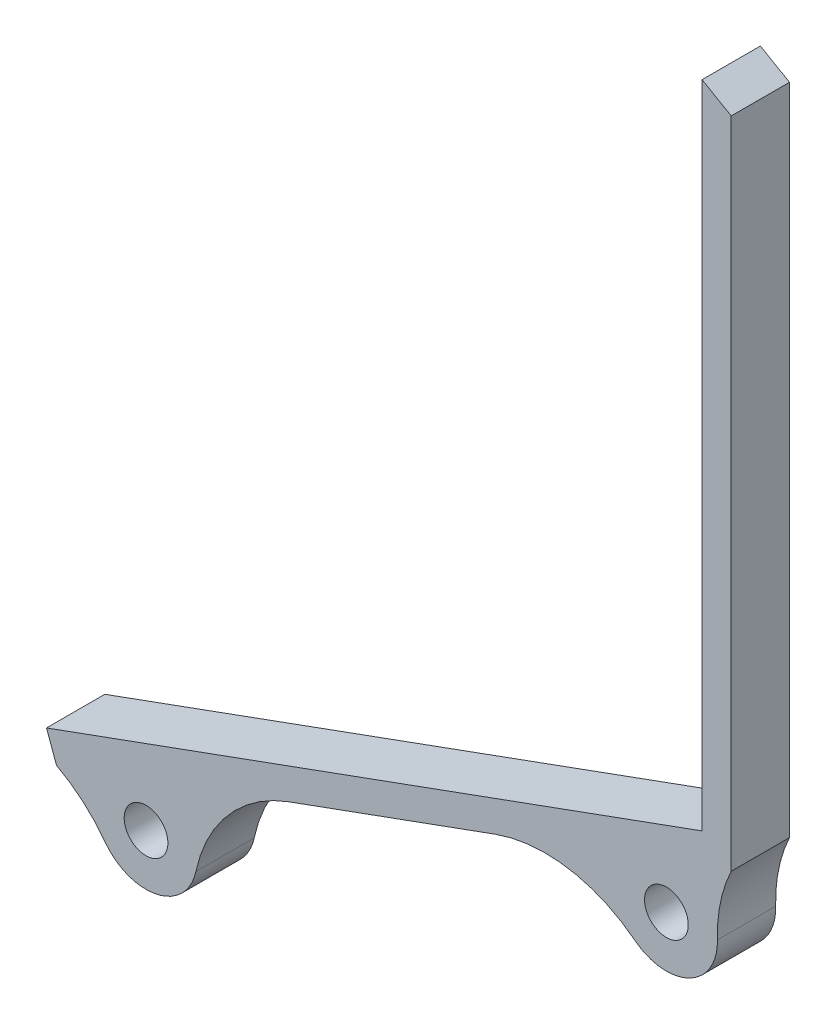
ISO-10303-21;
HEADER;
FILE_DESCRIPTION(('STEP AP214'),'2;1');
FILE_NAME('part.step','',(''),(''),'','','');
FILE_SCHEMA(('AUTOMOTIVE_DESIGN { 1 0 10303 214 1 1 1 1 }'));
ENDSEC;
DATA;
#1=APPLICATION_CONTEXT('core data for automotive mechanical design processes');
#2=APPLICATION_PROTOCOL_DEFINITION('international standard','automotive_design',2000,#1);
#3=PRODUCT_CONTEXT('',#1,'mechanical');
#4=PRODUCT('Part','Part','',(#3));
#5=PRODUCT_RELATED_PRODUCT_CATEGORY('part','',(#4));
#6=PRODUCT_DEFINITION_FORMATION('','',#4);
#7=PRODUCT_DEFINITION_CONTEXT('part definition',#1,'design');
#8=PRODUCT_DEFINITION('design','',#6,#7);
#9=PRODUCT_DEFINITION_SHAPE('','',#8);
#10=(LENGTH_UNIT() NAMED_UNIT(*) SI_UNIT(.MILLI.,.METRE.));
#11=(NAMED_UNIT(*) PLANE_ANGLE_UNIT() SI_UNIT($,.RADIAN.));
#12=(NAMED_UNIT(*) SI_UNIT($,.STERADIAN.) SOLID_ANGLE_UNIT());
#13=UNCERTAINTY_MEASURE_WITH_UNIT(LENGTH_MEASURE(1.E-05),#10,'distance_accuracy_value','');
#14=(GEOMETRIC_REPRESENTATION_CONTEXT(3) GLOBAL_UNCERTAINTY_ASSIGNED_CONTEXT((#13)) GLOBAL_UNIT_ASSIGNED_CONTEXT((#10,
#11,#12)) REPRESENTATION_CONTEXT('',''));
#15=CARTESIAN_POINT('',(0.,0.,0.));
#16=DIRECTION('',(0.,0.,1.));
#17=DIRECTION('',(1.,0.,0.));
#18=AXIS2_PLACEMENT_3D('',#15,#16,#17);
#19=CARTESIAN_POINT('',(13.5014281052641,-37.094868849603,4.));
#20=DIRECTION('',(0.34202014332567,-0.939692620785908,0.));
#21=DIRECTION('',(0.939692620785908,0.34202014332567,0.));
#22=AXIS2_PLACEMENT_3D('',#19,#20,#21);
#23=PLANE('',#22);
#24=DIRECTION('',(-0.939692620785908,-0.34202014332567,0.));
#25=VECTOR('',#24,1.);
#26=CARTESIAN_POINT('',(13.5014281052641,-37.094868849603,4.));
#27=LINE('',#26,#25);
#28=CARTESIAN_POINT('',(53.8122158515418,-22.4229419901351,4.));
#29=VERTEX_POINT('',#28);
#30=CARTESIAN_POINT('',(39.6315410616797,-27.584285515454,4.));
#31=VERTEX_POINT('',#30);
#32=EDGE_CURVE('E149',#29,#31,#27,.T.);
#33=ORIENTED_EDGE('',*,*,#32,.T.);
#34=DIRECTION('',(0.,0.,1.));
#35=VECTOR('',#34,1.);
#36=CARTESIAN_POINT('',(39.6315410616796,-27.584285515454,0.));
#37=LINE('',#36,#35);
#38=CARTESIAN_POINT('',(39.6315410616797,-27.584285515454,0.));
#39=VERTEX_POINT('',#38);
#40=EDGE_CURVE('E180',#31,#39,#37,.F.);
#41=ORIENTED_EDGE('',*,*,#40,.T.);
#42=DIRECTION('',(-0.939692620785908,-0.34202014332567,0.));
#43=VECTOR('',#42,1.);
#44=CARTESIAN_POINT('',(13.5014281052641,-37.094868849603,0.));
#45=LINE('',#44,#43);
#46=CARTESIAN_POINT('',(53.8122158515418,-22.4229419901351,0.));
#47=VERTEX_POINT('',#46);
#48=EDGE_CURVE('E172',#47,#39,#45,.T.);
#49=ORIENTED_EDGE('',*,*,#48,.F.);
#50=DIRECTION('',(0.,0.,1.));
#51=VECTOR('',#50,1.);
#52=CARTESIAN_POINT('',(53.8122158515418,-22.422941990135,4.00000000000001));
#53=LINE('',#52,#51);
#54=EDGE_CURVE('E177',#47,#29,#53,.T.);
#55=ORIENTED_EDGE('',*,*,#54,.T.);
#56=EDGE_LOOP('',(#33,#41,#49,#55));
#57=FACE_BOUND('',#56,.T.);
#58=ADVANCED_FACE('F39',(#57),#23,.T.);
#59=CARTESIAN_POINT('',(10.1979811420919,3.71176158532951,4.));
#60=DIRECTION('',(-0.939692620785908,-0.342020143325669,0.));
#61=DIRECTION('',(0.342020143325669,-0.939692620785908,0.));
#62=AXIS2_PLACEMENT_3D('',#59,#60,#61);
#63=PLANE('',#62);
#64=DIRECTION('',(-0.342020143325669,0.939692620785908,0.));
#65=VECTOR('',#64,1.);
#66=CARTESIAN_POINT('',(10.1979811420919,3.71176158532951,0.));
#67=LINE('',#66,#65);
#68=CARTESIAN_POINT('',(23.699409247356,-33.3831072642735,0.));
#69=VERTEX_POINT('',#68);
#70=CARTESIAN_POINT('',(23.0153689607046,-31.5037220227017,0.));
#71=VERTEX_POINT('',#70);
#72=EDGE_CURVE('E134',#69,#71,#67,.T.);
#73=ORIENTED_EDGE('',*,*,#72,.F.);
#74=DIRECTION('',(0.,0.,-1.));
#75=VECTOR('',#74,1.);
#76=CARTESIAN_POINT('',(23.699409247356,-33.3831072642735,4.));
#77=LINE('',#76,#75);
#78=CARTESIAN_POINT('',(23.699409247356,-33.3831072642735,4.));
#79=VERTEX_POINT('',#78);
#80=EDGE_CURVE('E129',#79,#69,#77,.T.);
#81=ORIENTED_EDGE('',*,*,#80,.F.);
#82=DIRECTION('',(-0.342020143325669,0.939692620785908,0.));
#83=VECTOR('',#82,1.);
#84=CARTESIAN_POINT('',(10.1979811420919,3.71176158532951,4.));
#85=LINE('',#84,#83);
#86=CARTESIAN_POINT('',(23.0153689607046,-31.5037220227017,4.));
#87=VERTEX_POINT('',#86);
#88=EDGE_CURVE('E132',#79,#87,#85,.T.);
#89=ORIENTED_EDGE('',*,*,#88,.T.);
#90=DIRECTION('',(0.,0.,-1.));
#91=VECTOR('',#90,1.);
#92=CARTESIAN_POINT('',(23.0153689607046,-31.5037220227017,4.));
#93=LINE('',#92,#91);
#94=EDGE_CURVE('E241',#87,#71,#93,.T.);
#95=ORIENTED_EDGE('',*,*,#94,.T.);
#96=EDGE_LOOP('',(#73,#81,#89,#95));
#97=FACE_BOUND('',#96,.T.);
#98=ADVANCED_FACE('F131',(#97),#63,.T.);
#99=CARTESIAN_POINT('',(70.,0.,4.));
#100=DIRECTION('',(1.,0.,0.));
#101=DIRECTION('',(0.,0.,-1.));
#102=AXIS2_PLACEMENT_3D('',#99,#100,#101);
#103=PLANE('',#102);
#104=DIRECTION('',(0.,-1.,0.));
#105=VECTOR('',#104,1.);
#106=CARTESIAN_POINT('',(70.,0.,0.));
#107=LINE('',#106,#105);
#108=CARTESIAN_POINT('',(70.,28.3589838486225,0.));
#109=VERTEX_POINT('',#108);
#110=CARTESIAN_POINT('',(70.,-16.53107040137,0.));
#111=VERTEX_POINT('',#110);
#112=EDGE_CURVE('E181',#109,#111,#107,.T.);
#113=ORIENTED_EDGE('',*,*,#112,.F.);
#114=DIRECTION('',(0.,0.,-1.));
#115=VECTOR('',#114,1.);
#116=CARTESIAN_POINT('',(70.,28.3589838486225,4.));
#117=LINE('',#116,#115);
#118=CARTESIAN_POINT('',(70.,28.3589838486225,4.));
#119=VERTEX_POINT('',#118);
#120=EDGE_CURVE('E207',#119,#109,#117,.T.);
#121=ORIENTED_EDGE('',*,*,#120,.F.);
#122=DIRECTION('',(0.,-1.,0.));
#123=VECTOR('',#122,1.);
#124=CARTESIAN_POINT('',(70.,0.,4.));
#125=LINE('',#124,#123);
#126=CARTESIAN_POINT('',(70.,-16.53107040137,4.));
#127=VERTEX_POINT('',#126);
#128=EDGE_CURVE('E234',#119,#127,#125,.T.);
#129=ORIENTED_EDGE('',*,*,#128,.T.);
#130=DIRECTION('',(0.,0.,-1.));
#131=VECTOR('',#130,1.);
#132=CARTESIAN_POINT('',(70.,-16.53107040137,4.));
#133=LINE('',#132,#131);
#134=EDGE_CURVE('E138',#127,#111,#133,.T.);
#135=ORIENTED_EDGE('',*,*,#134,.T.);
#136=EDGE_LOOP('',(#113,#121,#129,#135));
#137=FACE_BOUND('',#136,.T.);
#138=ADVANCED_FACE('F281',(#137),#103,.T.);
#139=CARTESIAN_POINT('',(29.7798002192095,51.5801270189222,4.));
#140=DIRECTION('',(-0.499999999999996,-0.866025403784441,0.));
#141=DIRECTION('',(0.866025403784441,-0.499999999999996,0.));
#142=AXIS2_PLACEMENT_3D('',#139,#140,#141);
#143=PLANE('',#142);
#144=DIRECTION('',(-0.866025403784441,0.499999999999996,0.));
#145=VECTOR('',#144,1.);
#146=CARTESIAN_POINT('',(29.7798002192095,51.5801270189222,0.));
#147=LINE('',#146,#145);
#148=CARTESIAN_POINT('',(68.,29.5136843870017,0.));
#149=VERTEX_POINT('',#148);
#150=EDGE_CURVE('E244',#109,#149,#147,.T.);
#151=ORIENTED_EDGE('',*,*,#150,.T.);
#152=DIRECTION('',(0.,0.,-1.));
#153=VECTOR('',#152,1.);
#154=CARTESIAN_POINT('',(68.,29.5136843870017,4.));
#155=LINE('',#154,#153);
#156=CARTESIAN_POINT('',(68.,29.5136843870017,4.));
#157=VERTEX_POINT('',#156);
#158=EDGE_CURVE('E209',#157,#149,#155,.T.);
#159=ORIENTED_EDGE('',*,*,#158,.F.);
#160=DIRECTION('',(-0.866025403784441,0.499999999999996,0.));
#161=VECTOR('',#160,1.);
#162=CARTESIAN_POINT('',(29.7798002192095,51.5801270189222,4.));
#163=LINE('',#162,#161);
#164=EDGE_CURVE('E236',#119,#157,#163,.T.);
#165=ORIENTED_EDGE('',*,*,#164,.F.);
#166=ORIENTED_EDGE('',*,*,#120,.T.);
#167=EDGE_LOOP('',(#151,#159,#165,#166));
#168=FACE_BOUND('',#167,.T.);
#169=ADVANCED_FACE('F273',(#168),#143,.F.);
#170=CARTESIAN_POINT('',(68.,0.,4.));
#171=DIRECTION('',(1.,0.,0.));
#172=DIRECTION('',(0.,0.,-1.));
#173=AXIS2_PLACEMENT_3D('',#170,#171,#172);
#174=PLANE('',#173);
#175=DIRECTION('',(0.,-1.,0.));
#176=VECTOR('',#175,1.);
#177=CARTESIAN_POINT('',(68.,0.,0.));
#178=LINE('',#177,#176);
#179=CARTESIAN_POINT('',(68.0000000000001,-15.1306553249505,0.));
#180=VERTEX_POINT('',#179);
#181=EDGE_CURVE('E246',#149,#180,#178,.T.);
#182=ORIENTED_EDGE('',*,*,#181,.T.);
#183=DIRECTION('',(0.,0.,-1.));
#184=VECTOR('',#183,1.);
#185=CARTESIAN_POINT('',(68.0000000000001,-15.1306553249505,4.));
#186=LINE('',#185,#184);
#187=CARTESIAN_POINT('',(68.0000000000001,-15.1306553249505,4.));
#188=VERTEX_POINT('',#187);
#189=EDGE_CURVE('E251',#188,#180,#186,.T.);
#190=ORIENTED_EDGE('',*,*,#189,.F.);
#191=DIRECTION('',(0.,-1.,0.));
#192=VECTOR('',#191,1.);
#193=CARTESIAN_POINT('',(68.,0.,4.));
#194=LINE('',#193,#192);
#195=EDGE_CURVE('E238',#157,#188,#194,.T.);
#196=ORIENTED_EDGE('',*,*,#195,.F.);
#197=ORIENTED_EDGE('',*,*,#158,.T.);
#198=EDGE_LOOP('',(#182,#190,#196,#197));
#199=FACE_BOUND('',#198,.T.);
#200=ADVANCED_FACE('F258',(#199),#174,.F.);
#201=CARTESIAN_POINT('',(12.8173878186128,-35.2154836080312,4.));
#202=DIRECTION('',(0.34202014332567,-0.939692620785908,0.));
#203=DIRECTION('',(0.939692620785908,0.34202014332567,0.));
#204=AXIS2_PLACEMENT_3D('',#201,#202,#203);
#205=PLANE('',#204);
#206=DIRECTION('',(-0.939692620785908,-0.34202014332567,0.));
#207=VECTOR('',#206,1.);
#208=CARTESIAN_POINT('',(12.8173878186128,-35.2154836080312,0.));
#209=LINE('',#208,#207);
#210=EDGE_CURVE('E150',#180,#71,#209,.T.);
#211=ORIENTED_EDGE('',*,*,#210,.T.);
#212=ORIENTED_EDGE('',*,*,#94,.F.);
#213=DIRECTION('',(-0.939692620785908,-0.34202014332567,0.));
#214=VECTOR('',#213,1.);
#215=CARTESIAN_POINT('',(12.8173878186128,-35.2154836080312,4.));
#216=LINE('',#215,#214);
#217=EDGE_CURVE('E147',#188,#87,#216,.T.);
#218=ORIENTED_EDGE('',*,*,#217,.F.);
#219=ORIENTED_EDGE('',*,*,#189,.T.);
#220=EDGE_LOOP('',(#211,#212,#218,#219));
#221=FACE_BOUND('',#220,.T.);
#222=ADVANCED_FACE('F265',(#221),#205,.F.);
#223=CARTESIAN_POINT('',(0.,0.,4.));
#224=DIRECTION('',(0.,0.,1.));
#225=DIRECTION('',(1.,0.,0.));
#226=AXIS2_PLACEMENT_3D('',#223,#224,#225);
#227=PLANE('',#226);
#228=ORIENTED_EDGE('',*,*,#88,.F.);
#229=CARTESIAN_POINT('',(18.9806996125584,-42.199783473734,4.));
#230=DIRECTION('',(0.,0.,1.));
#231=DIRECTION('',(1.,0.,0.));
#232=AXIS2_PLACEMENT_3D('',#229,#230,#231);
#233=CIRCLE('',#232,10.);
#234=CARTESIAN_POINT('',(27.0278925881678,-36.263228478343,4.));
#235=VERTEX_POINT('',#234);
#236=EDGE_CURVE('E144',#79,#235,#233,.F.);
#237=ORIENTED_EDGE('',*,*,#236,.T.);
#238=CARTESIAN_POINT('',(29.8444101296311,-34.1854342299562,4.));
#239=DIRECTION('',(0.,0.,1.));
#240=DIRECTION('',(1.,0.,0.));
#241=AXIS2_PLACEMENT_3D('',#238,#239,#240);
#242=CIRCLE('',#241,3.5);
#243=CARTESIAN_POINT('',(33.268533335451,-34.9102654319376,4.));
#244=VERTEX_POINT('',#243);
#245=EDGE_CURVE('E216',#244,#235,#242,.F.);
#246=ORIENTED_EDGE('',*,*,#245,.F.);
#247=CARTESIAN_POINT('',(43.0517424949364,-36.9812117233131,4.));
#248=DIRECTION('',(0.,0.,1.));
#249=DIRECTION('',(1.,0.,0.));
#250=AXIS2_PLACEMENT_3D('',#247,#248,#249);
#251=CIRCLE('',#250,10.);
#252=EDGE_CURVE('E159',#244,#31,#251,.F.);
#253=ORIENTED_EDGE('',*,*,#252,.T.);
#254=ORIENTED_EDGE('',*,*,#32,.F.);
#255=CARTESIAN_POINT('',(57.2324172847985,-31.8198681979941,4.));
#256=DIRECTION('',(0.,0.,1.));
#257=DIRECTION('',(1.,0.,0.));
#258=AXIS2_PLACEMENT_3D('',#255,#256,#257);
#259=CIRCLE('',#258,10.);
#260=CARTESIAN_POINT('',(63.3956116808704,-23.944905668799,4.));
#261=VERTEX_POINT('',#260);
#262=EDGE_CURVE('E12',#29,#261,#259,.F.);
#263=ORIENTED_EDGE('',*,*,#262,.T.);
#264=CARTESIAN_POINT('',(65.5527297194956,-21.1886687835807,4.));
#265=DIRECTION('',(0.,0.,1.));
#266=DIRECTION('',(1.,0.,0.));
#267=AXIS2_PLACEMENT_3D('',#264,#265,#266);
#268=CIRCLE('',#267,3.5);
#269=CARTESIAN_POINT('',(69.0512168953448,-21.0857733005934,4.));
#270=VERTEX_POINT('',#269);
#271=EDGE_CURVE('E195',#270,#261,#268,.F.);
#272=ORIENTED_EDGE('',*,*,#271,.F.);
#273=CARTESIAN_POINT('',(79.046894540628,-20.7917862063441,4.));
#274=DIRECTION('',(0.,0.,1.));
#275=DIRECTION('',(1.,0.,0.));
#276=AXIS2_PLACEMENT_3D('',#273,#274,#275);
#277=CIRCLE('',#276,10.);
#278=EDGE_CURVE('E167',#270,#127,#277,.F.);
#279=ORIENTED_EDGE('',*,*,#278,.T.);
#280=ORIENTED_EDGE('',*,*,#128,.F.);
#281=ORIENTED_EDGE('',*,*,#164,.T.);
#282=ORIENTED_EDGE('',*,*,#195,.T.);
#283=ORIENTED_EDGE('',*,*,#217,.T.);
#284=EDGE_LOOP('',(#228,#237,#246,#253,#254,#263,#272,#279,#280,#281,#282,#283));
#285=FACE_BOUND('',#284,.T.);
#286=CARTESIAN_POINT('',(29.8444101296311,-34.1854342299562,4.));
#287=DIRECTION('',(0.,0.,1.));
#288=DIRECTION('',(1.,0.,0.));
#289=AXIS2_PLACEMENT_3D('',#286,#287,#288);
#290=CIRCLE('',#289,1.5);
#291=CARTESIAN_POINT('',(28.3444101296311,-34.1854342299562,4.));
#292=VERTEX_POINT('',#291);
#293=EDGE_CURVE('E225',#292,#292,#290,.F.);
#294=ORIENTED_EDGE('',*,*,#293,.T.);
#295=EDGE_LOOP('',(#294));
#296=FACE_BOUND('',#295,.T.);
#297=CARTESIAN_POINT('',(65.5527297194956,-21.1886687835807,4.));
#298=DIRECTION('',(0.,0.,1.));
#299=DIRECTION('',(1.,0.,0.));
#300=AXIS2_PLACEMENT_3D('',#297,#298,#299);
#301=CIRCLE('',#300,1.5);
#302=CARTESIAN_POINT('',(64.0527297194956,-21.1886687835807,4.));
#303=VERTEX_POINT('',#302);
#304=EDGE_CURVE('E222',#303,#303,#301,.F.);
#305=ORIENTED_EDGE('',*,*,#304,.T.);
#306=EDGE_LOOP('',(#305));
#307=FACE_BOUND('',#306,.T.);
#308=ADVANCED_FACE('F141',(#285,#296,#307),#227,.T.);
#309=CARTESIAN_POINT('',(0.,0.,0.));
#310=DIRECTION('',(0.,0.,1.));
#311=DIRECTION('',(1.,0.,0.));
#312=AXIS2_PLACEMENT_3D('',#309,#310,#311);
#313=PLANE('',#312);
#314=ORIENTED_EDGE('',*,*,#72,.T.);
#315=ORIENTED_EDGE('',*,*,#210,.F.);
#316=ORIENTED_EDGE('',*,*,#181,.F.);
#317=ORIENTED_EDGE('',*,*,#150,.F.);
#318=ORIENTED_EDGE('',*,*,#112,.T.);
#319=CARTESIAN_POINT('',(79.046894540628,-20.7917862063441,0.));
#320=DIRECTION('',(0.,0.,1.));
#321=DIRECTION('',(1.,0.,0.));
#322=AXIS2_PLACEMENT_3D('',#319,#320,#321);
#323=CIRCLE('',#322,10.);
#324=CARTESIAN_POINT('',(69.0512168953448,-21.0857733005934,0.));
#325=VERTEX_POINT('',#324);
#326=EDGE_CURVE('E61',#111,#325,#323,.T.);
#327=ORIENTED_EDGE('',*,*,#326,.T.);
#328=CARTESIAN_POINT('',(65.5527297194956,-21.1886687835807,0.));
#329=DIRECTION('',(0.,0.,-1.));
#330=DIRECTION('',(-1.,0.,0.));
#331=AXIS2_PLACEMENT_3D('',#328,#329,#330);
#332=CIRCLE('',#331,3.5);
#333=CARTESIAN_POINT('',(63.3956116808704,-23.944905668799,0.));
#334=VERTEX_POINT('',#333);
#335=EDGE_CURVE('E173',#325,#334,#332,.T.);
#336=ORIENTED_EDGE('',*,*,#335,.T.);
#337=CARTESIAN_POINT('',(57.2324172847985,-31.8198681979941,0.));
#338=DIRECTION('',(0.,0.,1.));
#339=DIRECTION('',(1.,0.,0.));
#340=AXIS2_PLACEMENT_3D('',#337,#338,#339);
#341=CIRCLE('',#340,10.);
#342=EDGE_CURVE('E47',#334,#47,#341,.T.);
#343=ORIENTED_EDGE('',*,*,#342,.T.);
#344=ORIENTED_EDGE('',*,*,#48,.T.);
#345=CARTESIAN_POINT('',(43.0517424949364,-36.9812117233131,0.));
#346=DIRECTION('',(0.,0.,1.));
#347=DIRECTION('',(1.,0.,0.));
#348=AXIS2_PLACEMENT_3D('',#345,#346,#347);
#349=CIRCLE('',#348,10.);
#350=CARTESIAN_POINT('',(33.268533335451,-34.9102654319376,0.));
#351=VERTEX_POINT('',#350);
#352=EDGE_CURVE('E156',#39,#351,#349,.T.);
#353=ORIENTED_EDGE('',*,*,#352,.T.);
#354=CARTESIAN_POINT('',(29.8444101296311,-34.1854342299562,0.));
#355=DIRECTION('',(0.,0.,-1.));
#356=DIRECTION('',(-1.,0.,0.));
#357=AXIS2_PLACEMENT_3D('',#354,#355,#356);
#358=CIRCLE('',#357,3.5);
#359=CARTESIAN_POINT('',(27.0278925881678,-36.263228478343,0.));
#360=VERTEX_POINT('',#359);
#361=EDGE_CURVE('E218',#351,#360,#358,.T.);
#362=ORIENTED_EDGE('',*,*,#361,.T.);
#363=CARTESIAN_POINT('',(18.9806996125584,-42.199783473734,0.));
#364=DIRECTION('',(0.,0.,1.));
#365=DIRECTION('',(1.,0.,0.));
#366=AXIS2_PLACEMENT_3D('',#363,#364,#365);
#367=CIRCLE('',#366,10.);
#368=EDGE_CURVE('E157',#360,#69,#367,.T.);
#369=ORIENTED_EDGE('',*,*,#368,.T.);
#370=EDGE_LOOP('',(#314,#315,#316,#317,#318,#327,#336,#343,#344,#353,#362,#369));
#371=FACE_BOUND('',#370,.T.);
#372=CARTESIAN_POINT('',(29.8444101296311,-34.1854342299562,0.));
#373=DIRECTION('',(0.,0.,-1.));
#374=DIRECTION('',(-1.,0.,0.));
#375=AXIS2_PLACEMENT_3D('',#372,#373,#374);
#376=CIRCLE('',#375,1.5);
#377=CARTESIAN_POINT('',(28.3444101296311,-34.1854342299562,0.));
#378=VERTEX_POINT('',#377);
#379=EDGE_CURVE('E221',#378,#378,#376,.T.);
#380=ORIENTED_EDGE('',*,*,#379,.F.);
#381=EDGE_LOOP('',(#380));
#382=FACE_BOUND('',#381,.T.);
#383=CARTESIAN_POINT('',(65.5527297194956,-21.1886687835807,0.));
#384=DIRECTION('',(0.,0.,-1.));
#385=DIRECTION('',(-1.,0.,0.));
#386=AXIS2_PLACEMENT_3D('',#383,#384,#385);
#387=CIRCLE('',#386,1.5);
#388=CARTESIAN_POINT('',(64.0527297194956,-21.1886687835807,0.));
#389=VERTEX_POINT('',#388);
#390=EDGE_CURVE('E200',#389,#389,#387,.T.);
#391=ORIENTED_EDGE('',*,*,#390,.F.);
#392=EDGE_LOOP('',(#391));
#393=FACE_BOUND('',#392,.T.);
#394=ADVANCED_FACE('F170',(#371,#382,#393),#313,.F.);
#395=CARTESIAN_POINT('',(29.8444101296311,-34.1854342299562,14.7133882777728));
#396=DIRECTION('',(0.,0.,-1.));
#397=DIRECTION('',(-1.,0.,0.));
#398=AXIS2_PLACEMENT_3D('',#395,#396,#397);
#399=CYLINDRICAL_SURFACE('',#398,3.5);
#400=ORIENTED_EDGE('',*,*,#245,.T.);
#401=DIRECTION('',(0.,0.,-1.));
#402=VECTOR('',#401,1.);
#403=CARTESIAN_POINT('',(27.0278925881678,-36.263228478343,14.7133882777728));
#404=LINE('',#403,#402);
#405=EDGE_CURVE('E155',#235,#360,#404,.T.);
#406=ORIENTED_EDGE('',*,*,#405,.T.);
#407=ORIENTED_EDGE('',*,*,#361,.F.);
#408=DIRECTION('',(0.,0.,-1.));
#409=VECTOR('',#408,1.);
#410=CARTESIAN_POINT('',(33.268533335451,-34.9102654319376,14.7133882777728));
#411=LINE('',#410,#409);
#412=EDGE_CURVE('E137',#351,#244,#411,.F.);
#413=ORIENTED_EDGE('',*,*,#412,.T.);
#414=EDGE_LOOP('',(#400,#406,#407,#413));
#415=FACE_BOUND('',#414,.T.);
#416=ADVANCED_FACE('F215',(#415),#399,.T.);
#417=CARTESIAN_POINT('',(29.8444101296311,-34.1854342299562,14.7133882777728));
#418=DIRECTION('',(0.,0.,-1.));
#419=DIRECTION('',(-1.,0.,0.));
#420=AXIS2_PLACEMENT_3D('',#417,#418,#419);
#421=CYLINDRICAL_SURFACE('',#420,1.5);
#422=CARTESIAN_POINT('',(28.3444101296311,-34.1854342299562,0.));
#423=CARTESIAN_POINT('',(28.3444101296311,-34.1854342299562,0.0416666666666684));
#424=CARTESIAN_POINT('',(28.3444101296311,-34.1854342299562,0.0833333333333351));
#425=CARTESIAN_POINT('',(28.3444101296311,-34.1854342299562,0.166666666666669));
#426=CARTESIAN_POINT('',(28.3444101296311,-34.1854342299562,0.208333333333335));
#427=CARTESIAN_POINT('',(28.3444101296311,-34.1854342299562,0.291666666666669));
#428=CARTESIAN_POINT('',(28.3444101296311,-34.1854342299562,0.333333333333335));
#429=CARTESIAN_POINT('',(28.3444101296311,-34.1854342299562,0.416666666666669));
#430=CARTESIAN_POINT('',(28.3444101296311,-34.1854342299562,0.458333333333335));
#431=CARTESIAN_POINT('',(28.3444101296311,-34.1854342299562,0.541666666666668));
#432=CARTESIAN_POINT('',(28.3444101296311,-34.1854342299562,0.583333333333334));
#433=CARTESIAN_POINT('',(28.3444101296311,-34.1854342299562,0.666666666666667));
#434=CARTESIAN_POINT('',(28.3444101296311,-34.1854342299562,0.708333333333334));
#435=CARTESIAN_POINT('',(28.3444101296311,-34.1854342299562,0.791666666666667));
#436=CARTESIAN_POINT('',(28.3444101296311,-34.1854342299562,0.833333333333334));
#437=CARTESIAN_POINT('',(28.3444101296311,-34.1854342299562,0.916666666666668));
#438=CARTESIAN_POINT('',(28.3444101296311,-34.1854342299562,0.958333333333334));
#439=CARTESIAN_POINT('',(28.3444101296311,-34.1854342299562,1.04166666666667));
#440=CARTESIAN_POINT('',(28.3444101296311,-34.1854342299562,1.08333333333333));
#441=CARTESIAN_POINT('',(28.3444101296311,-34.1854342299562,1.16666666666667));
#442=CARTESIAN_POINT('',(28.3444101296311,-34.1854342299562,1.20833333333333));
#443=CARTESIAN_POINT('',(28.3444101296311,-34.1854342299562,1.29166666666667));
#444=CARTESIAN_POINT('',(28.3444101296311,-34.1854342299562,1.33333333333333));
#445=CARTESIAN_POINT('',(28.3444101296311,-34.1854342299562,1.41666666666667));
#446=CARTESIAN_POINT('',(28.3444101296311,-34.1854342299562,1.45833333333333));
#447=CARTESIAN_POINT('',(28.3444101296311,-34.1854342299562,1.54166666666667));
#448=CARTESIAN_POINT('',(28.3444101296311,-34.1854342299562,1.58333333333333));
#449=CARTESIAN_POINT('',(28.3444101296311,-34.1854342299562,1.66666666666667));
#450=CARTESIAN_POINT('',(28.3444101296311,-34.1854342299562,1.70833333333333));
#451=CARTESIAN_POINT('',(28.3444101296311,-34.1854342299562,1.79166666666667));
#452=CARTESIAN_POINT('',(28.3444101296311,-34.1854342299562,1.83333333333333));
#453=CARTESIAN_POINT('',(28.3444101296311,-34.1854342299562,1.91666666666667));
#454=CARTESIAN_POINT('',(28.3444101296311,-34.1854342299562,1.95833333333333));
#455=CARTESIAN_POINT('',(28.3444101296311,-34.1854342299562,2.04166666666667));
#456=CARTESIAN_POINT('',(28.3444101296311,-34.1854342299562,2.08333333333333));
#457=CARTESIAN_POINT('',(28.3444101296311,-34.1854342299562,2.16666666666667));
#458=CARTESIAN_POINT('',(28.3444101296311,-34.1854342299562,2.20833333333333));
#459=CARTESIAN_POINT('',(28.3444101296311,-34.1854342299562,2.29166666666667));
#460=CARTESIAN_POINT('',(28.3444101296311,-34.1854342299562,2.33333333333333));
#461=CARTESIAN_POINT('',(28.3444101296311,-34.1854342299562,2.41666666666667));
#462=CARTESIAN_POINT('',(28.3444101296311,-34.1854342299562,2.45833333333333));
#463=CARTESIAN_POINT('',(28.3444101296311,-34.1854342299562,2.54166666666667));
#464=CARTESIAN_POINT('',(28.3444101296311,-34.1854342299562,2.58333333333333));
#465=CARTESIAN_POINT('',(28.3444101296311,-34.1854342299562,2.66666666666667));
#466=CARTESIAN_POINT('',(28.3444101296311,-34.1854342299562,2.70833333333333));
#467=CARTESIAN_POINT('',(28.3444101296311,-34.1854342299562,2.79166666666667));
#468=CARTESIAN_POINT('',(28.3444101296311,-34.1854342299562,2.83333333333333));
#469=CARTESIAN_POINT('',(28.3444101296311,-34.1854342299562,2.91666666666667));
#470=CARTESIAN_POINT('',(28.3444101296311,-34.1854342299562,2.95833333333333));
#471=CARTESIAN_POINT('',(28.3444101296311,-34.1854342299562,3.04166666666667));
#472=CARTESIAN_POINT('',(28.3444101296311,-34.1854342299562,3.08333333333333));
#473=CARTESIAN_POINT('',(28.3444101296311,-34.1854342299562,3.16666666666667));
#474=CARTESIAN_POINT('',(28.3444101296311,-34.1854342299562,3.20833333333333));
#475=CARTESIAN_POINT('',(28.3444101296311,-34.1854342299562,3.29166666666667));
#476=CARTESIAN_POINT('',(28.3444101296311,-34.1854342299562,3.33333333333333));
#477=CARTESIAN_POINT('',(28.3444101296311,-34.1854342299562,3.41666666666666));
#478=CARTESIAN_POINT('',(28.3444101296311,-34.1854342299562,3.45833333333333));
#479=CARTESIAN_POINT('',(28.3444101296311,-34.1854342299562,3.54166666666666));
#480=CARTESIAN_POINT('',(28.3444101296311,-34.1854342299562,3.58333333333333));
#481=CARTESIAN_POINT('',(28.3444101296311,-34.1854342299562,3.66666666666666));
#482=CARTESIAN_POINT('',(28.3444101296311,-34.1854342299562,3.70833333333333));
#483=CARTESIAN_POINT('',(28.3444101296311,-34.1854342299562,3.79166666666667));
#484=CARTESIAN_POINT('',(28.3444101296311,-34.1854342299562,3.83333333333333));
#485=CARTESIAN_POINT('',(28.3444101296311,-34.1854342299562,3.91666666666666));
#486=CARTESIAN_POINT('',(28.3444101296311,-34.1854342299562,3.95833333333333));
#487=CARTESIAN_POINT('',(28.3444101296311,-34.1854342299562,4.));
#488=B_SPLINE_CURVE_WITH_KNOTS('',3,(#422,#423,#424,#425,#426,#427,#428,#429,#430,#431,#432,
#433,#434,#435,#436,#437,#438,#439,#440,#441,#442,#443,#444,#445,#446,#447,#448,#449,#450,#451,
#452,#453,#454,#455,#456,#457,#458,#459,#460,#461,#462,#463,#464,#465,#466,#467,#468,#469,#470,
#471,#472,#473,#474,#475,#476,#477,#478,#479,#480,#481,#482,#483,#484,#485,#486,#487),
.UNSPECIFIED.,.F.,.F.,(4,2,2,2,2,2,2,2,2,2,2,2,2,2,2,2,2,2,2,2,2,2,2,2,2,2,2,2,2,2,2,2,4),(0.,
0.125,0.25,0.375,0.5,0.624999999999999,0.749999999999999,0.874999999999999,0.999999999999999,
1.125,1.25,1.375,1.5,1.625,1.75,1.875,2.,2.125,2.25,2.375,2.5,2.625,2.75,2.875,3.,3.125,3.25,
3.375,3.5,3.625,3.75,3.875,4.),.UNSPECIFIED.);
#489=EDGE_CURVE('BSEAM323',#378,#292,#488,.T.);
#490=ORIENTED_EDGE('',*,*,#379,.T.);
#491=ORIENTED_EDGE('',*,*,#293,.F.);
#492=ORIENTED_EDGE('',*,*,#489,.T.);
#493=ORIENTED_EDGE('',*,*,#489,.F.);
#494=EDGE_LOOP('',(#490,#492,#491,#493));
#495=FACE_BOUND('',#494,.T.);
#496=ADVANCED_FACE('F323',(#495),#421,.F.);
#497=CARTESIAN_POINT('',(65.5527297194956,-21.1886687835807,14.7133882777728));
#498=DIRECTION('',(0.,0.,-1.));
#499=DIRECTION('',(-1.,0.,0.));
#500=AXIS2_PLACEMENT_3D('',#497,#498,#499);
#501=CYLINDRICAL_SURFACE('',#500,3.5);
#502=ORIENTED_EDGE('',*,*,#335,.F.);
#503=DIRECTION('',(0.,0.,-1.));
#504=VECTOR('',#503,1.);
#505=CARTESIAN_POINT('',(69.0512168953448,-21.0857733005934,14.7133882777728));
#506=LINE('',#505,#504);
#507=EDGE_CURVE('E161',#325,#270,#506,.F.);
#508=ORIENTED_EDGE('',*,*,#507,.T.);
#509=ORIENTED_EDGE('',*,*,#271,.T.);
#510=DIRECTION('',(0.,0.,-1.));
#511=VECTOR('',#510,1.);
#512=CARTESIAN_POINT('',(63.3956116808704,-23.944905668799,14.7133882777728));
#513=LINE('',#512,#511);
#514=EDGE_CURVE('E185',#261,#334,#513,.T.);
#515=ORIENTED_EDGE('',*,*,#514,.T.);
#516=EDGE_LOOP('',(#502,#508,#509,#515));
#517=FACE_BOUND('',#516,.T.);
#518=ADVANCED_FACE('F194',(#517),#501,.T.);
#519=CARTESIAN_POINT('',(65.5527297194956,-21.1886687835807,14.7133882777728));
#520=DIRECTION('',(0.,0.,-1.));
#521=DIRECTION('',(-1.,0.,0.));
#522=AXIS2_PLACEMENT_3D('',#519,#520,#521);
#523=CYLINDRICAL_SURFACE('',#522,1.5);
#524=CARTESIAN_POINT('',(64.0527297194956,-21.1886687835807,0.));
#525=CARTESIAN_POINT('',(64.0527297194956,-21.1886687835807,0.0416666666666684));
#526=CARTESIAN_POINT('',(64.0527297194956,-21.1886687835807,0.0833333333333351));
#527=CARTESIAN_POINT('',(64.0527297194956,-21.1886687835807,0.166666666666669));
#528=CARTESIAN_POINT('',(64.0527297194956,-21.1886687835807,0.208333333333335));
#529=CARTESIAN_POINT('',(64.0527297194956,-21.1886687835807,0.291666666666669));
#530=CARTESIAN_POINT('',(64.0527297194956,-21.1886687835807,0.333333333333335));
#531=CARTESIAN_POINT('',(64.0527297194956,-21.1886687835807,0.416666666666669));
#532=CARTESIAN_POINT('',(64.0527297194956,-21.1886687835807,0.458333333333335));
#533=CARTESIAN_POINT('',(64.0527297194956,-21.1886687835807,0.541666666666668));
#534=CARTESIAN_POINT('',(64.0527297194956,-21.1886687835807,0.583333333333334));
#535=CARTESIAN_POINT('',(64.0527297194956,-21.1886687835807,0.666666666666667));
#536=CARTESIAN_POINT('',(64.0527297194956,-21.1886687835807,0.708333333333334));
#537=CARTESIAN_POINT('',(64.0527297194956,-21.1886687835807,0.791666666666667));
#538=CARTESIAN_POINT('',(64.0527297194956,-21.1886687835807,0.833333333333334));
#539=CARTESIAN_POINT('',(64.0527297194956,-21.1886687835807,0.916666666666668));
#540=CARTESIAN_POINT('',(64.0527297194956,-21.1886687835807,0.958333333333334));
#541=CARTESIAN_POINT('',(64.0527297194956,-21.1886687835807,1.04166666666667));
#542=CARTESIAN_POINT('',(64.0527297194956,-21.1886687835807,1.08333333333333));
#543=CARTESIAN_POINT('',(64.0527297194956,-21.1886687835807,1.16666666666667));
#544=CARTESIAN_POINT('',(64.0527297194956,-21.1886687835807,1.20833333333333));
#545=CARTESIAN_POINT('',(64.0527297194956,-21.1886687835807,1.29166666666667));
#546=CARTESIAN_POINT('',(64.0527297194956,-21.1886687835807,1.33333333333333));
#547=CARTESIAN_POINT('',(64.0527297194956,-21.1886687835807,1.41666666666667));
#548=CARTESIAN_POINT('',(64.0527297194956,-21.1886687835807,1.45833333333333));
#549=CARTESIAN_POINT('',(64.0527297194956,-21.1886687835807,1.54166666666667));
#550=CARTESIAN_POINT('',(64.0527297194956,-21.1886687835807,1.58333333333333));
#551=CARTESIAN_POINT('',(64.0527297194956,-21.1886687835807,1.66666666666667));
#552=CARTESIAN_POINT('',(64.0527297194956,-21.1886687835807,1.70833333333333));
#553=CARTESIAN_POINT('',(64.0527297194956,-21.1886687835807,1.79166666666667));
#554=CARTESIAN_POINT('',(64.0527297194956,-21.1886687835807,1.83333333333333));
#555=CARTESIAN_POINT('',(64.0527297194956,-21.1886687835807,1.91666666666667));
#556=CARTESIAN_POINT('',(64.0527297194956,-21.1886687835807,1.95833333333333));
#557=CARTESIAN_POINT('',(64.0527297194956,-21.1886687835807,2.04166666666667));
#558=CARTESIAN_POINT('',(64.0527297194956,-21.1886687835807,2.08333333333333));
#559=CARTESIAN_POINT('',(64.0527297194956,-21.1886687835807,2.16666666666667));
#560=CARTESIAN_POINT('',(64.0527297194956,-21.1886687835807,2.20833333333333));
#561=CARTESIAN_POINT('',(64.0527297194956,-21.1886687835807,2.29166666666667));
#562=CARTESIAN_POINT('',(64.0527297194956,-21.1886687835807,2.33333333333333));
#563=CARTESIAN_POINT('',(64.0527297194956,-21.1886687835807,2.41666666666667));
#564=CARTESIAN_POINT('',(64.0527297194956,-21.1886687835807,2.45833333333333));
#565=CARTESIAN_POINT('',(64.0527297194956,-21.1886687835807,2.54166666666667));
#566=CARTESIAN_POINT('',(64.0527297194956,-21.1886687835807,2.58333333333333));
#567=CARTESIAN_POINT('',(64.0527297194956,-21.1886687835807,2.66666666666667));
#568=CARTESIAN_POINT('',(64.0527297194956,-21.1886687835807,2.70833333333333));
#569=CARTESIAN_POINT('',(64.0527297194956,-21.1886687835807,2.79166666666667));
#570=CARTESIAN_POINT('',(64.0527297194956,-21.1886687835807,2.83333333333333));
#571=CARTESIAN_POINT('',(64.0527297194956,-21.1886687835807,2.91666666666667));
#572=CARTESIAN_POINT('',(64.0527297194956,-21.1886687835807,2.95833333333333));
#573=CARTESIAN_POINT('',(64.0527297194956,-21.1886687835807,3.04166666666667));
#574=CARTESIAN_POINT('',(64.0527297194956,-21.1886687835807,3.08333333333333));
#575=CARTESIAN_POINT('',(64.0527297194956,-21.1886687835807,3.16666666666667));
#576=CARTESIAN_POINT('',(64.0527297194956,-21.1886687835807,3.20833333333333));
#577=CARTESIAN_POINT('',(64.0527297194956,-21.1886687835807,3.29166666666667));
#578=CARTESIAN_POINT('',(64.0527297194956,-21.1886687835807,3.33333333333333));
#579=CARTESIAN_POINT('',(64.0527297194956,-21.1886687835807,3.41666666666666));
#580=CARTESIAN_POINT('',(64.0527297194956,-21.1886687835807,3.45833333333333));
#581=CARTESIAN_POINT('',(64.0527297194956,-21.1886687835807,3.54166666666666));
#582=CARTESIAN_POINT('',(64.0527297194956,-21.1886687835807,3.58333333333333));
#583=CARTESIAN_POINT('',(64.0527297194956,-21.1886687835807,3.66666666666666));
#584=CARTESIAN_POINT('',(64.0527297194956,-21.1886687835807,3.70833333333333));
#585=CARTESIAN_POINT('',(64.0527297194956,-21.1886687835807,3.79166666666667));
#586=CARTESIAN_POINT('',(64.0527297194956,-21.1886687835807,3.83333333333333));
#587=CARTESIAN_POINT('',(64.0527297194956,-21.1886687835807,3.91666666666666));
#588=CARTESIAN_POINT('',(64.0527297194956,-21.1886687835807,3.95833333333333));
#589=CARTESIAN_POINT('',(64.0527297194956,-21.1886687835807,4.));
#590=B_SPLINE_CURVE_WITH_KNOTS('',3,(#524,#525,#526,#527,#528,#529,#530,#531,#532,#533,#534,
#535,#536,#537,#538,#539,#540,#541,#542,#543,#544,#545,#546,#547,#548,#549,#550,#551,#552,#553,
#554,#555,#556,#557,#558,#559,#560,#561,#562,#563,#564,#565,#566,#567,#568,#569,#570,#571,#572,
#573,#574,#575,#576,#577,#578,#579,#580,#581,#582,#583,#584,#585,#586,#587,#588,#589),
.UNSPECIFIED.,.F.,.F.,(4,2,2,2,2,2,2,2,2,2,2,2,2,2,2,2,2,2,2,2,2,2,2,2,2,2,2,2,2,2,2,2,4),(0.,
0.125,0.25,0.375,0.5,0.624999999999999,0.749999999999999,0.874999999999999,0.999999999999999,
1.125,1.25,1.375,1.5,1.625,1.75,1.875,2.,2.125,2.25,2.375,2.5,2.625,2.75,2.875,3.,3.125,3.25,
3.375,3.5,3.625,3.75,3.875,4.),.UNSPECIFIED.);
#591=EDGE_CURVE('BSEAM288',#389,#303,#590,.T.);
#592=ORIENTED_EDGE('',*,*,#390,.T.);
#593=ORIENTED_EDGE('',*,*,#304,.F.);
#594=ORIENTED_EDGE('',*,*,#591,.T.);
#595=ORIENTED_EDGE('',*,*,#591,.F.);
#596=EDGE_LOOP('',(#592,#594,#593,#595));
#597=FACE_BOUND('',#596,.T.);
#598=ADVANCED_FACE('F288',(#597),#523,.F.);
#599=CARTESIAN_POINT('',(18.9806996125584,-42.199783473734,4.));
#600=DIRECTION('',(0.,0.,1.));
#601=DIRECTION('',(1.,0.,0.));
#602=AXIS2_PLACEMENT_3D('',#599,#600,#601);
#603=CYLINDRICAL_SURFACE('',#602,10.);
#604=ORIENTED_EDGE('',*,*,#236,.F.);
#605=ORIENTED_EDGE('',*,*,#80,.T.);
#606=ORIENTED_EDGE('',*,*,#368,.F.);
#607=ORIENTED_EDGE('',*,*,#405,.F.);
#608=EDGE_LOOP('',(#604,#605,#606,#607));
#609=FACE_BOUND('',#608,.T.);
#610=ADVANCED_FACE('F153',(#609),#603,.F.);
#611=CARTESIAN_POINT('',(43.0517424949364,-36.9812117233131,14.7133882777728));
#612=DIRECTION('',(0.,0.,-1.));
#613=DIRECTION('',(-1.,0.,0.));
#614=AXIS2_PLACEMENT_3D('',#611,#612,#613);
#615=CYLINDRICAL_SURFACE('',#614,10.);
#616=ORIENTED_EDGE('',*,*,#252,.F.);
#617=ORIENTED_EDGE('',*,*,#412,.F.);
#618=ORIENTED_EDGE('',*,*,#352,.F.);
#619=ORIENTED_EDGE('',*,*,#40,.F.);
#620=EDGE_LOOP('',(#616,#617,#618,#619));
#621=FACE_BOUND('',#620,.T.);
#622=ADVANCED_FACE('F224',(#621),#615,.F.);
#623=CARTESIAN_POINT('',(79.046894540628,-20.7917862063441,14.7133882777728));
#624=DIRECTION('',(0.,0.,1.));
#625=DIRECTION('',(1.,0.,0.));
#626=AXIS2_PLACEMENT_3D('',#623,#624,#625);
#627=CYLINDRICAL_SURFACE('',#626,10.);
#628=ORIENTED_EDGE('',*,*,#278,.F.);
#629=ORIENTED_EDGE('',*,*,#507,.F.);
#630=ORIENTED_EDGE('',*,*,#326,.F.);
#631=ORIENTED_EDGE('',*,*,#134,.F.);
#632=EDGE_LOOP('',(#628,#629,#630,#631));
#633=FACE_BOUND('',#632,.T.);
#634=ADVANCED_FACE('F203',(#633),#627,.F.);
#635=CARTESIAN_POINT('',(57.2324172847985,-31.8198681979941,14.7133882777728));
#636=DIRECTION('',(0.,0.,-1.));
#637=DIRECTION('',(-1.,0.,0.));
#638=AXIS2_PLACEMENT_3D('',#635,#636,#637);
#639=CYLINDRICAL_SURFACE('',#638,10.);
#640=ORIENTED_EDGE('',*,*,#262,.F.);
#641=ORIENTED_EDGE('',*,*,#54,.F.);
#642=ORIENTED_EDGE('',*,*,#342,.F.);
#643=ORIENTED_EDGE('',*,*,#514,.F.);
#644=EDGE_LOOP('',(#640,#641,#642,#643));
#645=FACE_BOUND('',#644,.T.);
#646=ADVANCED_FACE('F41',(#645),#639,.F.);
#647=CLOSED_SHELL('',(#58,#98,#138,#169,#200,#222,#308,#394,#416,#496,#518,#598,#610,#622,#634,#646));
#648=MANIFOLD_SOLID_BREP('B2',#647);
#649=ADVANCED_BREP_SHAPE_REPRESENTATION('',(#18,#648),#14);
#650=SHAPE_DEFINITION_REPRESENTATION(#9,#649);
ENDSEC;
END-ISO-10303-21;
